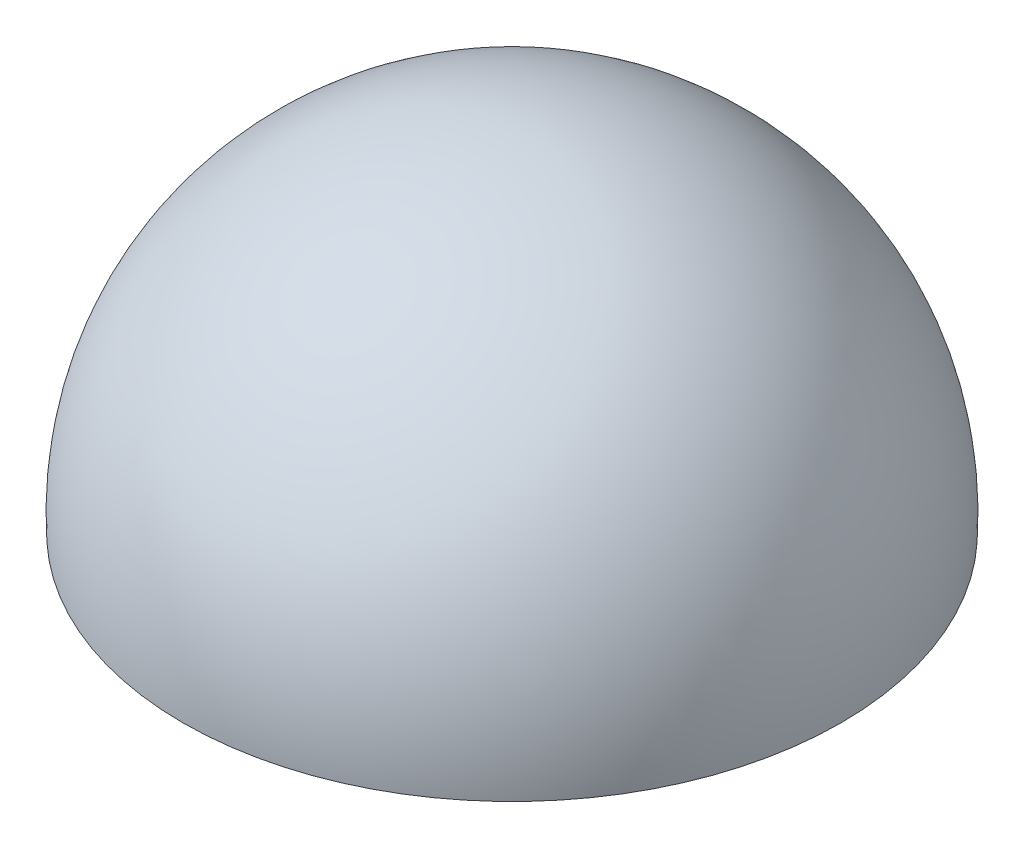
ISO-10303-21;
HEADER;
FILE_DESCRIPTION(('STEP AP214'),'2;1');
FILE_NAME('part.step','',(''),(''),'','','');
FILE_SCHEMA(('AUTOMOTIVE_DESIGN { 1 0 10303 214 1 1 1 1 }'));
ENDSEC;
DATA;
#1=APPLICATION_CONTEXT('core data for automotive mechanical design processes');
#2=APPLICATION_PROTOCOL_DEFINITION('international standard','automotive_design',2000,#1);
#3=PRODUCT_CONTEXT('',#1,'mechanical');
#4=PRODUCT('Part','Part','',(#3));
#5=PRODUCT_RELATED_PRODUCT_CATEGORY('part','',(#4));
#6=PRODUCT_DEFINITION_FORMATION('','',#4);
#7=PRODUCT_DEFINITION_CONTEXT('part definition',#1,'design');
#8=PRODUCT_DEFINITION('design','',#6,#7);
#9=PRODUCT_DEFINITION_SHAPE('','',#8);
#10=(LENGTH_UNIT() NAMED_UNIT(*) SI_UNIT(.MILLI.,.METRE.));
#11=(NAMED_UNIT(*) PLANE_ANGLE_UNIT() SI_UNIT($,.RADIAN.));
#12=(NAMED_UNIT(*) SI_UNIT($,.STERADIAN.) SOLID_ANGLE_UNIT());
#13=UNCERTAINTY_MEASURE_WITH_UNIT(LENGTH_MEASURE(1.E-05),#10,'distance_accuracy_value','');
#14=(GEOMETRIC_REPRESENTATION_CONTEXT(3) GLOBAL_UNCERTAINTY_ASSIGNED_CONTEXT((#13)) GLOBAL_UNIT_ASSIGNED_CONTEXT((#10,
#11,#12)) REPRESENTATION_CONTEXT('',''));
#15=CARTESIAN_POINT('',(0.,0.,0.));
#16=DIRECTION('',(0.,0.,1.));
#17=DIRECTION('',(1.,0.,0.));
#18=AXIS2_PLACEMENT_3D('',#15,#16,#17);
#19=CARTESIAN_POINT('',(-27.4962714054708,-13.0717558599828,0.));
#20=DIRECTION('',(0.,1.,0.));
#21=DIRECTION('',(-1.,0.,0.));
#22=AXIS2_PLACEMENT_3D('',#19,#20,#21);
#23=PLANE('',#22);
#24=CARTESIAN_POINT('',(0.,-13.0717558599828,0.));
#25=DIRECTION('',(0.,-1.,0.));
#26=DIRECTION('',(1.,0.,0.));
#27=AXIS2_PLACEMENT_3D('',#24,#25,#26);
#28=CIRCLE('',#27,27.4962714054708);
#29=CARTESIAN_POINT('',(27.4962714054708,-13.0717558599828,0.));
#30=VERTEX_POINT('',#29);
#31=EDGE_CURVE('E10',#30,#30,#28,.T.);
#32=ORIENTED_EDGE('',*,*,#31,.T.);
#33=EDGE_LOOP('',(#32));
#34=FACE_BOUND('',#33,.T.);
#35=ADVANCED_FACE('F32',(#34),#23,.F.);
#36=CARTESIAN_POINT('',(0.,-11.6070134669364,0.));
#37=DIRECTION('',(0.,-1.,0.));
#38=DIRECTION('',(-1.,0.,0.));
#39=AXIS2_PLACEMENT_3D('',#36,#37,#38);
#40=SPHERICAL_SURFACE('',#39,27.5352576069536);
#41=ORIENTED_EDGE('',*,*,#31,.F.);
#42=EDGE_LOOP('',(#41));
#43=FACE_BOUND('',#42,.T.);
#44=ADVANCED_FACE('F56',(#43),#40,.T.);
#45=CLOSED_SHELL('',(#35,#44));
#46=CARTESIAN_POINT('',(-26.5,-12.0717558599828,0.));
#47=DIRECTION('',(0.,1.,0.));
#48=DIRECTION('',(0.,0.,1.));
#49=AXIS2_PLACEMENT_3D('',#46,#47,#48);
#50=PLANE('',#49);
#51=CARTESIAN_POINT('',(0.,-12.0717558599828,0.));
#52=DIRECTION('',(0.,-1.,0.));
#53=DIRECTION('',(0.,0.,-1.));
#54=AXIS2_PLACEMENT_3D('',#51,#52,#53);
#55=CIRCLE('',#54,26.5);
#56=CARTESIAN_POINT('',(0.,-12.0717558599828,-26.5));
#57=VERTEX_POINT('',#56);
#58=EDGE_CURVE('E38',#57,#57,#55,.T.);
#59=ORIENTED_EDGE('',*,*,#58,.F.);
#60=EDGE_LOOP('',(#59));
#61=FACE_BOUND('',#60,.T.);
#62=ADVANCED_FACE('F46',(#61),#50,.T.);
#63=CARTESIAN_POINT('',(0.,-11.5853759679489,0.));
#64=DIRECTION('',(0.,-1.,0.));
#65=DIRECTION('',(1.,0.,0.));
#66=AXIS2_PLACEMENT_3D('',#63,#64,#65);
#67=SPHERICAL_SURFACE('',#66,26.5044631222625);
#68=ORIENTED_EDGE('',*,*,#58,.T.);
#69=EDGE_LOOP('',(#68));
#70=FACE_BOUND('',#69,.T.);
#71=ADVANCED_FACE('F44',(#70),#67,.F.);
#72=CLOSED_SHELL('',(#62,#71));
#73=ORIENTED_CLOSED_SHELL('',*,#72,.T.);
#74=BREP_WITH_VOIDS('B2',#45,(#73));
#75=ADVANCED_BREP_SHAPE_REPRESENTATION('',(#18,#74),#14);
#76=SHAPE_DEFINITION_REPRESENTATION(#9,#75);
ENDSEC;
END-ISO-10303-21;
